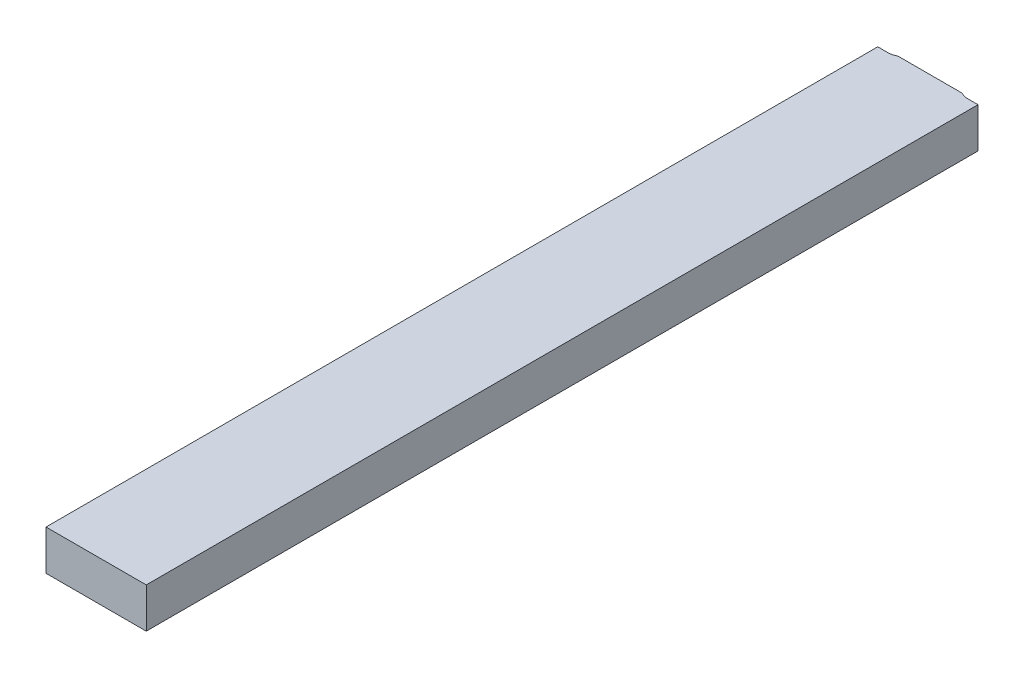
ISO-10303-21;
HEADER;
FILE_DESCRIPTION(('STEP AP214'),'2;1');
FILE_NAME('part.step','',(''),(''),'','','');
FILE_SCHEMA(('AUTOMOTIVE_DESIGN { 1 0 10303 214 1 1 1 1 }'));
ENDSEC;
DATA;
#1=APPLICATION_CONTEXT('core data for automotive mechanical design processes');
#2=APPLICATION_PROTOCOL_DEFINITION('international standard','automotive_design',2000,#1);
#3=PRODUCT_CONTEXT('',#1,'mechanical');
#4=PRODUCT('Part','Part','',(#3));
#5=PRODUCT_RELATED_PRODUCT_CATEGORY('part','',(#4));
#6=PRODUCT_DEFINITION_FORMATION('','',#4);
#7=PRODUCT_DEFINITION_CONTEXT('part definition',#1,'design');
#8=PRODUCT_DEFINITION('design','',#6,#7);
#9=PRODUCT_DEFINITION_SHAPE('','',#8);
#10=(LENGTH_UNIT() NAMED_UNIT(*) SI_UNIT(.MILLI.,.METRE.));
#11=(NAMED_UNIT(*) PLANE_ANGLE_UNIT() SI_UNIT($,.RADIAN.));
#12=(NAMED_UNIT(*) SI_UNIT($,.STERADIAN.) SOLID_ANGLE_UNIT());
#13=UNCERTAINTY_MEASURE_WITH_UNIT(LENGTH_MEASURE(1.E-05),#10,'distance_accuracy_value','');
#14=(GEOMETRIC_REPRESENTATION_CONTEXT(3) GLOBAL_UNCERTAINTY_ASSIGNED_CONTEXT((#13)) GLOBAL_UNIT_ASSIGNED_CONTEXT((#10,
#11,#12)) REPRESENTATION_CONTEXT('',''));
#15=CARTESIAN_POINT('',(0.,0.,0.));
#16=DIRECTION('',(0.,0.,1.));
#17=DIRECTION('',(1.,0.,0.));
#18=AXIS2_PLACEMENT_3D('',#15,#16,#17);
#19=CARTESIAN_POINT('',(4.5,0.275,-4.982138483571));
#20=DIRECTION('',(0.,1.,0.));
#21=DIRECTION('',(0.,0.,1.));
#22=AXIS2_PLACEMENT_3D('',#19,#20,#21);
#23=PLANE('',#22);
#24=DIRECTION('',(1.,0.,0.));
#25=VECTOR('',#24,1.);
#26=CARTESIAN_POINT('',(4.275,0.275,-7.051158663985));
#27=LINE('',#26,#25);
#28=CARTESIAN_POINT('',(4.25,0.275,-7.051158663985));
#29=VERTEX_POINT('',#28);
#30=CARTESIAN_POINT('',(4.30000000000174,0.275,-7.05115866398515));
#31=VERTEX_POINT('',#30);
#32=EDGE_CURVE('E184',#29,#31,#27,.T.);
#33=ORIENTED_EDGE('',*,*,#32,.T.);
#34=CARTESIAN_POINT('',(4.33925609382097,0.275,-7.06145062487903));
#35=CARTESIAN_POINT('',(4.33569437934613,0.275,-7.05943829430754));
#36=CARTESIAN_POINT('',(4.33197691458712,0.275,-7.05770911016996));
#37=CARTESIAN_POINT('',(4.324321331602,0.275,-7.05483826908998));
#38=CARTESIAN_POINT('',(4.32038321330713,0.275,-7.05369661233063));
#39=CARTESIAN_POINT('',(4.31100059388692,0.275,-7.05173413514556));
#40=CARTESIAN_POINT('',(4.3055037799839,0.275,-7.05115865434742));
#41=CARTESIAN_POINT('',(4.30000000000348,0.275,-7.0511586639853));
#42=B_SPLINE_CURVE_WITH_KNOTS('',3,(#34,#35,#36,#37,#38,#39,#40,#41),.UNSPECIFIED.,.F.,.F.,(4,2,
2,4),(0.,0.012254200982868,0.0245084057837979,0.0409766482847958),.UNSPECIFIED.);
#43=CARTESIAN_POINT('',(4.33925609382097,0.275,-7.06145062487903));
#44=VERTEX_POINT('',#43);
#45=EDGE_CURVE('E93',#44,#31,#42,.T.);
#46=ORIENTED_EDGE('',*,*,#45,.F.);
#47=DIRECTION('',(1.,0.,0.));
#48=VECTOR('',#47,1.);
#49=CARTESIAN_POINT('',(4.500000048205,0.275,-7.061450624879));
#50=LINE('',#49,#48);
#51=CARTESIAN_POINT('',(4.660744002588,0.275,-7.06145062487899));
#52=VERTEX_POINT('',#51);
#53=EDGE_CURVE('E89',#44,#52,#50,.T.);
#54=ORIENTED_EDGE('',*,*,#53,.T.);
#55=CARTESIAN_POINT('',(4.69999999999649,0.275,-7.05115866398509));
#56=CARTESIAN_POINT('',(4.69591120722722,0.275,-7.05116284562048));
#57=CARTESIAN_POINT('',(4.69182388666645,0.275,-7.05148113218099));
#58=CARTESIAN_POINT('',(4.68374332584176,0.275,-7.05273057454798));
#59=CARTESIAN_POINT('',(4.67975010047702,0.275,-7.05366182674584));
#60=CARTESIAN_POINT('',(4.67060917233445,0.275,-7.05654480111922));
#61=CARTESIAN_POINT('',(4.66553664971063,0.275,-7.05873731135742));
#62=CARTESIAN_POINT('',(4.660744002588,0.275,-7.06145062487899));
#63=B_SPLINE_CURVE_WITH_KNOTS('',3,(#55,#56,#57,#58,#59,#60,#61,#62),.UNSPECIFIED.,.F.,.F.,(4,2,
2,4),(0.,0.0122527379750504,0.0245074032044942,0.0409759652394017),.UNSPECIFIED.);
#64=CARTESIAN_POINT('',(4.69999999999825,0.275,-7.05115866398507));
#65=VERTEX_POINT('',#64);
#66=EDGE_CURVE('E21',#65,#52,#63,.T.);
#67=ORIENTED_EDGE('',*,*,#66,.F.);
#68=DIRECTION('',(1.,0.,0.));
#69=VECTOR('',#68,1.);
#70=CARTESIAN_POINT('',(4.725,0.275,-7.051158663985));
#71=LINE('',#70,#69);
#72=CARTESIAN_POINT('',(4.75,0.275,-7.051158663985));
#73=VERTEX_POINT('',#72);
#74=EDGE_CURVE('E84',#65,#73,#71,.T.);
#75=ORIENTED_EDGE('',*,*,#74,.T.);
#76=DIRECTION('',(0.,0.,-1.));
#77=VECTOR('',#76,1.);
#78=CARTESIAN_POINT('',(4.75,0.275,-4.976992503125));
#79=LINE('',#78,#77);
#80=CARTESIAN_POINT('',(4.75,0.275,-2.902826342264));
#81=VERTEX_POINT('',#80);
#82=EDGE_CURVE('E218',#81,#73,#79,.T.);
#83=ORIENTED_EDGE('',*,*,#82,.F.);
#84=DIRECTION('',(1.,0.,0.));
#85=VECTOR('',#84,1.);
#86=CARTESIAN_POINT('',(4.5,0.275,-2.902826342264));
#87=LINE('',#86,#85);
#88=CARTESIAN_POINT('',(4.25,0.275,-2.902826342264));
#89=VERTEX_POINT('',#88);
#90=EDGE_CURVE('E204',#89,#81,#87,.T.);
#91=ORIENTED_EDGE('',*,*,#90,.F.);
#92=DIRECTION('',(0.,0.,-1.));
#93=VECTOR('',#92,1.);
#94=CARTESIAN_POINT('',(4.25,0.275,-4.976992503125));
#95=LINE('',#94,#93);
#96=EDGE_CURVE('E176',#89,#29,#95,.T.);
#97=ORIENTED_EDGE('',*,*,#96,.T.);
#98=EDGE_LOOP('',(#33,#46,#54,#67,#75,#83,#91,#97));
#99=FACE_BOUND('',#98,.T.);
#100=ADVANCED_FACE('F17',(#99),#23,.F.);
#101=CARTESIAN_POINT('',(4.75,0.375,-4.976992503125));
#102=DIRECTION('',(1.,0.,0.));
#103=DIRECTION('',(0.,0.,-1.));
#104=AXIS2_PLACEMENT_3D('',#101,#102,#103);
#105=PLANE('',#104);
#106=DIRECTION('',(0.,0.,1.));
#107=VECTOR('',#106,1.);
#108=CARTESIAN_POINT('',(4.75,0.475,-4.982138483572));
#109=LINE('',#108,#107);
#110=CARTESIAN_POINT('',(4.75,0.475,-2.902826342264));
#111=VERTEX_POINT('',#110);
#112=CARTESIAN_POINT('',(4.75,0.475,-7.051158663985));
#113=VERTEX_POINT('',#112);
#114=EDGE_CURVE('E189',#111,#113,#109,.F.);
#115=ORIENTED_EDGE('',*,*,#114,.F.);
#116=DIRECTION('',(0.,1.,0.));
#117=VECTOR('',#116,1.);
#118=CARTESIAN_POINT('',(4.75,0.375,-2.902826342264));
#119=LINE('',#118,#117);
#120=EDGE_CURVE('E203',#81,#111,#119,.T.);
#121=ORIENTED_EDGE('',*,*,#120,.F.);
#122=ORIENTED_EDGE('',*,*,#82,.T.);
#123=DIRECTION('',(0.,1.,0.));
#124=VECTOR('',#123,1.);
#125=CARTESIAN_POINT('',(4.75,0.375,-7.051158663985));
#126=LINE('',#125,#124);
#127=EDGE_CURVE('E233',#73,#113,#126,.T.);
#128=ORIENTED_EDGE('',*,*,#127,.T.);
#129=EDGE_LOOP('',(#115,#121,#122,#128));
#130=FACE_BOUND('',#129,.T.);
#131=ADVANCED_FACE('F238',(#130),#105,.T.);
#132=CARTESIAN_POINT('',(4.725,0.375,-7.051158663985));
#133=DIRECTION('',(0.,0.,1.));
#134=DIRECTION('',(1.,0.,0.));
#135=AXIS2_PLACEMENT_3D('',#132,#133,#134);
#136=PLANE('',#135);
#137=DIRECTION('',(1.,0.,0.));
#138=VECTOR('',#137,1.);
#139=CARTESIAN_POINT('',(4.5,0.475,-7.051158663985));
#140=LINE('',#139,#138);
#141=CARTESIAN_POINT('',(4.69999992664067,0.475,-7.05115866418436));
#142=VERTEX_POINT('',#141);
#143=EDGE_CURVE('E135',#113,#142,#140,.F.);
#144=ORIENTED_EDGE('',*,*,#143,.F.);
#145=ORIENTED_EDGE('',*,*,#127,.F.);
#146=ORIENTED_EDGE('',*,*,#74,.F.);
#147=DIRECTION('',(0.,1.,0.));
#148=VECTOR('',#147,1.);
#149=CARTESIAN_POINT('',(4.7,0.2699679840491,-7.05115866398508));
#150=LINE('',#149,#148);
#151=EDGE_CURVE('E103',#142,#65,#150,.F.);
#152=ORIENTED_EDGE('',*,*,#151,.F.);
#153=EDGE_LOOP('',(#144,#145,#146,#152));
#154=FACE_BOUND('',#153,.T.);
#155=ADVANCED_FACE('F125',(#154),#136,.F.);
#156=CARTESIAN_POINT('',(4.70251960942,0.2699679840491,-7.051190309039));
#157=CARTESIAN_POINT('',(4.70168041762,0.2699679840491,-7.051166943388));
#158=CARTESIAN_POINT('',(4.695615002363,0.2699679840491,-7.051090682037));
#159=CARTESIAN_POINT('',(4.684291413794,0.2699679840491,-7.052195104335));
#160=CARTESIAN_POINT('',(4.671141350335,0.2699679840491,-7.056177217872));
#161=CARTESIAN_POINT('',(4.662024122149,0.2699679840491,-7.060613467733));
#162=CARTESIAN_POINT('',(4.657842502067,0.2699679840491,-7.063145821386));
#163=CARTESIAN_POINT('',(4.656433777303,0.2699679840491,-7.064061090588));
#164=(BOUNDED_CURVE() B_SPLINE_CURVE(3,(#156,#157,#158,#159,#160,#161,#162,#163),.UNSPECIFIED.,
.F.,.F.) B_SPLINE_CURVE_WITH_KNOTS((4,1,1,1,1,4),(0.,0.05196482602244,0.3752098129395,
0.6983604955075,0.8962889073999,1.),
.UNSPECIFIED.) CURVE() GEOMETRIC_REPRESENTATION_ITEM() RATIONAL_B_SPLINE_CURVE((1.,1.,1.,1.,1.,
1.,1.,1.)) REPRESENTATION_ITEM(''));
#165=DIRECTION('',(0.,1.,0.));
#166=VECTOR('',#165,1.);
#167=SURFACE_OF_LINEAR_EXTRUSION('',#164,#166);
#168=ORIENTED_EDGE('',*,*,#66,.T.);
#169=DIRECTION('',(0.,1.,0.));
#170=VECTOR('',#169,1.);
#171=CARTESIAN_POINT('',(4.660744002588,0.375,-7.061450624879));
#172=LINE('',#171,#170);
#173=CARTESIAN_POINT('',(4.660744002588,0.475,-7.061450624879));
#174=VERTEX_POINT('',#173);
#175=EDGE_CURVE('E97',#52,#174,#172,.T.);
#176=ORIENTED_EDGE('',*,*,#175,.T.);
#177=CARTESIAN_POINT('',(4.69999985328134,0.475,-7.05115866438369));
#178=CARTESIAN_POINT('',(4.69591106051827,0.475,-7.0511628532203));
#179=CARTESIAN_POINT('',(4.69182374051208,0.475,-7.05148114713333));
#180=CARTESIAN_POINT('',(4.6837431819355,0.475,-7.05273060421157));
#181=CARTESIAN_POINT('',(4.6797499582645,0.475,-7.05366186376829));
#182=CARTESIAN_POINT('',(4.67060908193835,0.475,-7.05654484039364));
#183=CARTESIAN_POINT('',(4.66553660692722,0.475,-7.05873733584115));
#184=CARTESIAN_POINT('',(4.660744002588,0.475,-7.06145062487898));
#185=B_SPLINE_CURVE_WITH_KNOTS('',3,(#177,#178,#179,#180,#181,#182,#183,#184),.UNSPECIFIED.,.F.,
.F.,(4,2,2,4),(0.,0.0122527379884823,0.0245074032339861,0.0409758193004605),.UNSPECIFIED.);
#186=EDGE_CURVE('E129',#142,#174,#185,.T.);
#187=ORIENTED_EDGE('',*,*,#186,.F.);
#188=ORIENTED_EDGE('',*,*,#151,.T.);
#189=EDGE_LOOP('',(#168,#176,#187,#188));
#190=FACE_BOUND('',#189,.T.);
#191=ADVANCED_FACE('F100',(#190),#167,.T.);
#192=CARTESIAN_POINT('',(4.500000048205,0.375,-7.061450624879));
#193=DIRECTION('',(0.,0.,1.));
#194=DIRECTION('',(1.,0.,0.));
#195=AXIS2_PLACEMENT_3D('',#192,#193,#194);
#196=PLANE('',#195);
#197=ORIENTED_EDGE('',*,*,#53,.F.);
#198=DIRECTION('',(0.,1.,0.));
#199=VECTOR('',#198,1.);
#200=CARTESIAN_POINT('',(4.33925609382098,0.2699679840491,-7.06145062487904));
#201=LINE('',#200,#199);
#202=CARTESIAN_POINT('',(4.33925609382098,0.475,-7.06145062487903));
#203=VERTEX_POINT('',#202);
#204=EDGE_CURVE('E109',#203,#44,#201,.F.);
#205=ORIENTED_EDGE('',*,*,#204,.F.);
#206=DIRECTION('',(1.,0.,0.));
#207=VECTOR('',#206,1.);
#208=CARTESIAN_POINT('',(4.5,0.475,-7.061450624879));
#209=LINE('',#208,#207);
#210=EDGE_CURVE('E106',#174,#203,#209,.F.);
#211=ORIENTED_EDGE('',*,*,#210,.F.);
#212=ORIENTED_EDGE('',*,*,#175,.F.);
#213=EDGE_LOOP('',(#197,#205,#211,#212));
#214=FACE_BOUND('',#213,.T.);
#215=ADVANCED_FACE('F104',(#214),#196,.F.);
#216=CARTESIAN_POINT('',(4.343566307542,0.2699679840491,-7.064061118802));
#217=CARTESIAN_POINT('',(4.34215758621,0.2699679840491,-7.063145841608));
#218=CARTESIAN_POINT('',(4.337978107331,0.2699679840491,-7.060614746012));
#219=CARTESIAN_POINT('',(4.32886198488,0.2699679840491,-7.056178456814));
#220=CARTESIAN_POINT('',(4.315712040602,0.2699679840491,-7.052195755785));
#221=CARTESIAN_POINT('',(4.304386746271,0.2699679840491,-7.051090694486));
#222=CARTESIAN_POINT('',(4.298321131782,0.2699679840491,-7.051166937919));
#223=CARTESIAN_POINT('',(4.297482711636,0.2699679840491,-7.051190272618));
#224=(BOUNDED_CURVE() B_SPLINE_CURVE(3,(#216,#217,#218,#219,#220,#221,#222,#223),.UNSPECIFIED.,
.F.,.F.) B_SPLINE_CURVE_WITH_KNOTS((4,1,1,1,1,4),(0.,0.1037158878781,0.3014998794713,
0.6247605212749,0.9480806664175,1.),
.UNSPECIFIED.) CURVE() GEOMETRIC_REPRESENTATION_ITEM() RATIONAL_B_SPLINE_CURVE((1.,1.,1.,1.,1.,
1.,1.,1.)) REPRESENTATION_ITEM(''));
#225=DIRECTION('',(0.,1.,0.));
#226=VECTOR('',#225,1.);
#227=SURFACE_OF_LINEAR_EXTRUSION('',#224,#226);
#228=CARTESIAN_POINT('',(4.33925609382097,0.475,-7.06145062487904));
#229=CARTESIAN_POINT('',(4.33569437936902,0.475,-7.05943829433274));
#230=CARTESIAN_POINT('',(4.33197691459857,0.475,-7.05770911018256));
#231=CARTESIAN_POINT('',(4.32432133159056,0.475,-7.05483826907738));
#232=CARTESIAN_POINT('',(4.32038321328425,0.475,-7.05369661230544));
#233=CARTESIAN_POINT('',(4.31100064163172,0.475,-7.05173414515934));
#234=CARTESIAN_POINT('',(4.30550387761474,0.475,-7.05115866469184));
#235=CARTESIAN_POINT('',(4.30000014681143,0.475,-7.05115866438328));
#236=B_SPLINE_CURVE_WITH_KNOTS('',3,(#228,#229,#230,#231,#232,#233,#234,#235),.UNSPECIFIED.,.F.,
.F.,(4,2,2,4),(0.,0.0122542009828679,0.0245084057838,0.0409765022206892),.UNSPECIFIED.);
#237=CARTESIAN_POINT('',(4.3,0.475,-7.051158663985));
#238=VERTEX_POINT('',#237);
#239=EDGE_CURVE('E136',#203,#238,#236,.T.);
#240=ORIENTED_EDGE('',*,*,#239,.F.);
#241=ORIENTED_EDGE('',*,*,#204,.T.);
#242=ORIENTED_EDGE('',*,*,#45,.T.);
#243=DIRECTION('',(0.,1.,0.));
#244=VECTOR('',#243,1.);
#245=CARTESIAN_POINT('',(4.3,0.375,-7.051158663985));
#246=LINE('',#245,#244);
#247=EDGE_CURVE('E182',#31,#238,#246,.T.);
#248=ORIENTED_EDGE('',*,*,#247,.T.);
#249=EDGE_LOOP('',(#240,#241,#242,#248));
#250=FACE_BOUND('',#249,.T.);
#251=ADVANCED_FACE('F159',(#250),#227,.T.);
#252=CARTESIAN_POINT('',(4.275,0.375,-7.051158663985));
#253=DIRECTION('',(0.,0.,1.));
#254=DIRECTION('',(1.,0.,0.));
#255=AXIS2_PLACEMENT_3D('',#252,#253,#254);
#256=PLANE('',#255);
#257=DIRECTION('',(1.,0.,0.));
#258=VECTOR('',#257,1.);
#259=CARTESIAN_POINT('',(4.5,0.475,-7.051158663985));
#260=LINE('',#259,#258);
#261=CARTESIAN_POINT('',(4.25,0.475,-7.051158663985));
#262=VERTEX_POINT('',#261);
#263=EDGE_CURVE('E181',#238,#262,#260,.F.);
#264=ORIENTED_EDGE('',*,*,#263,.F.);
#265=ORIENTED_EDGE('',*,*,#247,.F.);
#266=ORIENTED_EDGE('',*,*,#32,.F.);
#267=DIRECTION('',(0.,1.,0.));
#268=VECTOR('',#267,1.);
#269=CARTESIAN_POINT('',(4.25,0.375,-7.051158663985));
#270=LINE('',#269,#268);
#271=EDGE_CURVE('E174',#29,#262,#270,.T.);
#272=ORIENTED_EDGE('',*,*,#271,.T.);
#273=EDGE_LOOP('',(#264,#265,#266,#272));
#274=FACE_BOUND('',#273,.T.);
#275=ADVANCED_FACE('F157',(#274),#256,.F.);
#276=CARTESIAN_POINT('',(4.25,0.375,-4.976992503125));
#277=DIRECTION('',(1.,0.,0.));
#278=DIRECTION('',(0.,0.,-1.));
#279=AXIS2_PLACEMENT_3D('',#276,#277,#278);
#280=PLANE('',#279);
#281=ORIENTED_EDGE('',*,*,#271,.F.);
#282=ORIENTED_EDGE('',*,*,#96,.F.);
#283=DIRECTION('',(0.,1.,0.));
#284=VECTOR('',#283,1.);
#285=CARTESIAN_POINT('',(4.25,0.375,-2.902826342264));
#286=LINE('',#285,#284);
#287=CARTESIAN_POINT('',(4.25,0.475,-2.902826342264));
#288=VERTEX_POINT('',#287);
#289=EDGE_CURVE('E40',#288,#89,#286,.F.);
#290=ORIENTED_EDGE('',*,*,#289,.F.);
#291=DIRECTION('',(0.,0.,1.));
#292=VECTOR('',#291,1.);
#293=CARTESIAN_POINT('',(4.25,0.475,-4.982138483572));
#294=LINE('',#293,#292);
#295=EDGE_CURVE('E31',#262,#288,#294,.T.);
#296=ORIENTED_EDGE('',*,*,#295,.F.);
#297=EDGE_LOOP('',(#281,#282,#290,#296));
#298=FACE_BOUND('',#297,.T.);
#299=ADVANCED_FACE('F153',(#298),#280,.F.);
#300=CARTESIAN_POINT('',(4.5,0.375,-2.902826342264));
#301=DIRECTION('',(0.,0.,1.));
#302=DIRECTION('',(1.,0.,0.));
#303=AXIS2_PLACEMENT_3D('',#300,#301,#302);
#304=PLANE('',#303);
#305=ORIENTED_EDGE('',*,*,#120,.T.);
#306=DIRECTION('',(1.,0.,0.));
#307=VECTOR('',#306,1.);
#308=CARTESIAN_POINT('',(4.5,0.475,-2.902826342264));
#309=LINE('',#308,#307);
#310=EDGE_CURVE('E11',#288,#111,#309,.T.);
#311=ORIENTED_EDGE('',*,*,#310,.F.);
#312=ORIENTED_EDGE('',*,*,#289,.T.);
#313=ORIENTED_EDGE('',*,*,#90,.T.);
#314=EDGE_LOOP('',(#305,#311,#312,#313));
#315=FACE_BOUND('',#314,.T.);
#316=ADVANCED_FACE('F148',(#315),#304,.T.);
#317=CARTESIAN_POINT('',(4.5,0.475,-4.982138483572));
#318=DIRECTION('',(0.,1.,0.));
#319=DIRECTION('',(0.,0.,1.));
#320=AXIS2_PLACEMENT_3D('',#317,#318,#319);
#321=PLANE('',#320);
#322=ORIENTED_EDGE('',*,*,#295,.T.);
#323=ORIENTED_EDGE('',*,*,#310,.T.);
#324=ORIENTED_EDGE('',*,*,#114,.T.);
#325=ORIENTED_EDGE('',*,*,#143,.T.);
#326=ORIENTED_EDGE('',*,*,#186,.T.);
#327=ORIENTED_EDGE('',*,*,#210,.T.);
#328=ORIENTED_EDGE('',*,*,#239,.T.);
#329=ORIENTED_EDGE('',*,*,#263,.T.);
#330=EDGE_LOOP('',(#322,#323,#324,#325,#326,#327,#328,#329));
#331=FACE_BOUND('',#330,.T.);
#332=ADVANCED_FACE('F144',(#331),#321,.T.);
#333=CLOSED_SHELL('',(#100,#131,#155,#191,#215,#251,#275,#299,#316,#332));
#334=MANIFOLD_SOLID_BREP('B1',#333);
#335=ADVANCED_BREP_SHAPE_REPRESENTATION('',(#18,#334),#14);
#336=SHAPE_DEFINITION_REPRESENTATION(#9,#335);
ENDSEC;
END-ISO-10303-21;
